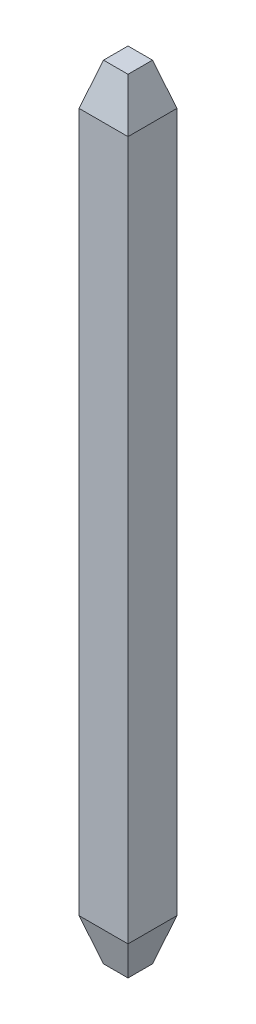
ISO-10303-21;
HEADER;
FILE_DESCRIPTION(('STEP AP214'),'2;1');
FILE_NAME('part.step','',(''),(''),'','','');
FILE_SCHEMA(('AUTOMOTIVE_DESIGN { 1 0 10303 214 1 1 1 1 }'));
ENDSEC;
DATA;
#1=APPLICATION_CONTEXT('core data for automotive mechanical design processes');
#2=APPLICATION_PROTOCOL_DEFINITION('international standard','automotive_design',2000,#1);
#3=PRODUCT_CONTEXT('',#1,'mechanical');
#4=PRODUCT('Part','Part','',(#3));
#5=PRODUCT_RELATED_PRODUCT_CATEGORY('part','',(#4));
#6=PRODUCT_DEFINITION_FORMATION('','',#4);
#7=PRODUCT_DEFINITION_CONTEXT('part definition',#1,'design');
#8=PRODUCT_DEFINITION('design','',#6,#7);
#9=PRODUCT_DEFINITION_SHAPE('','',#8);
#10=(LENGTH_UNIT() NAMED_UNIT(*) SI_UNIT(.MILLI.,.METRE.));
#11=(NAMED_UNIT(*) PLANE_ANGLE_UNIT() SI_UNIT($,.RADIAN.));
#12=(NAMED_UNIT(*) SI_UNIT($,.STERADIAN.) SOLID_ANGLE_UNIT());
#13=UNCERTAINTY_MEASURE_WITH_UNIT(LENGTH_MEASURE(1.E-05),#10,'distance_accuracy_value','');
#14=(GEOMETRIC_REPRESENTATION_CONTEXT(3) GLOBAL_UNCERTAINTY_ASSIGNED_CONTEXT((#13)) GLOBAL_UNIT_ASSIGNED_CONTEXT((#10,
#11,#12)) REPRESENTATION_CONTEXT('',''));
#15=CARTESIAN_POINT('',(0.,0.,0.));
#16=DIRECTION('',(0.,0.,1.));
#17=DIRECTION('',(1.,0.,0.));
#18=AXIS2_PLACEMENT_3D('',#15,#16,#17);
#19=CARTESIAN_POINT('',(11.5900000000129,-10.1039999999831,-19.8399999999763));
#20=DIRECTION('',(0.,-0.281214622974644,-0.959644900900968));
#21=DIRECTION('',(0.,-0.959644900900968,0.281214622974644));
#22=AXIS2_PLACEMENT_3D('',#19,#20,#21);
#23=PLANE('',#22);
#24=DIRECTION('',(1.,0.,0.));
#25=VECTOR('',#24,1.);
#26=CARTESIAN_POINT('',(11.2700000000129,-10.1039999999831,-19.8399999999763));
#27=LINE('',#26,#25);
#28=CARTESIAN_POINT('',(11.2700000000129,-10.1039999999831,-19.8399999999763));
#29=VERTEX_POINT('',#28);
#30=CARTESIAN_POINT('',(11.9100000000129,-10.1039999999831,-19.8399999999763));
#31=VERTEX_POINT('',#30);
#32=EDGE_CURVE('E11',#29,#31,#27,.T.);
#33=ORIENTED_EDGE('',*,*,#32,.T.);
#34=DIRECTION('',(-0.270714017147728,-0.923811583516617,0.270714017147728));
#35=VECTOR('',#34,1.);
#36=CARTESIAN_POINT('',(11.9100000000129,-10.1039999999831,-19.8399999999763));
#37=LINE('',#36,#35);
#38=CARTESIAN_POINT('',(11.7500000000129,-10.6499999999831,-19.6799999999763));
#39=VERTEX_POINT('',#38);
#40=EDGE_CURVE('E28',#31,#39,#37,.T.);
#41=ORIENTED_EDGE('',*,*,#40,.T.);
#42=DIRECTION('',(1.,0.,0.));
#43=VECTOR('',#42,1.);
#44=CARTESIAN_POINT('',(11.4300000000129,-10.6499999999831,-19.6799999999763));
#45=LINE('',#44,#43);
#46=CARTESIAN_POINT('',(11.4300000000129,-10.6499999999831,-19.6799999999763));
#47=VERTEX_POINT('',#46);
#48=EDGE_CURVE('E135',#47,#39,#45,.T.);
#49=ORIENTED_EDGE('',*,*,#48,.F.);
#50=DIRECTION('',(0.270714017147728,-0.923811583516617,0.270714017147728));
#51=VECTOR('',#50,1.);
#52=CARTESIAN_POINT('',(11.2700000000129,-10.1039999999831,-19.8399999999763));
#53=LINE('',#52,#51);
#54=EDGE_CURVE('E114',#29,#47,#53,.T.);
#55=ORIENTED_EDGE('',*,*,#54,.F.);
#56=EDGE_LOOP('',(#33,#41,#49,#55));
#57=FACE_BOUND('',#56,.T.);
#58=ADVANCED_FACE('F17',(#57),#23,.T.);
#59=CARTESIAN_POINT('',(11.9110000000129,-5.53443505344787,-19.8399999999763));
#60=DIRECTION('',(0.,0.,-1.));
#61=DIRECTION('',(0.,-1.,0.));
#62=AXIS2_PLACEMENT_3D('',#59,#60,#61);
#63=PLANE('',#62);
#64=DIRECTION('',(0.,1.,0.));
#65=VECTOR('',#64,1.);
#66=CARTESIAN_POINT('',(11.9100000000129,-10.1039999999831,-19.8399999999763));
#67=LINE('',#66,#65);
#68=CARTESIAN_POINT('',(11.9100000000129,-0.965870106912631,-19.8399999999763));
#69=VERTEX_POINT('',#68);
#70=EDGE_CURVE('E42',#31,#69,#67,.T.);
#71=ORIENTED_EDGE('',*,*,#70,.F.);
#72=ORIENTED_EDGE('',*,*,#32,.F.);
#73=DIRECTION('',(0.,1.,0.));
#74=VECTOR('',#73,1.);
#75=CARTESIAN_POINT('',(11.2700000000129,-10.1039999999831,-19.8399999999763));
#76=LINE('',#75,#74);
#77=CARTESIAN_POINT('',(11.2700000000129,-0.965870106912631,-19.8399999999763));
#78=VERTEX_POINT('',#77);
#79=EDGE_CURVE('E112',#29,#78,#76,.T.);
#80=ORIENTED_EDGE('',*,*,#79,.T.);
#81=DIRECTION('',(1.,0.,0.));
#82=VECTOR('',#81,1.);
#83=CARTESIAN_POINT('',(11.2700000000129,-0.965870106912629,-19.8399999999763));
#84=LINE('',#83,#82);
#85=EDGE_CURVE('E134',#78,#69,#84,.T.);
#86=ORIENTED_EDGE('',*,*,#85,.T.);
#87=EDGE_LOOP('',(#71,#72,#80,#86));
#88=FACE_BOUND('',#87,.T.);
#89=ADVANCED_FACE('F350',(#88),#63,.T.);
#90=CARTESIAN_POINT('',(11.9100000000129,-11.0738701069126,-19.5199999999763));
#91=DIRECTION('',(1.,0.,0.));
#92=DIRECTION('',(0.,1.,0.));
#93=AXIS2_PLACEMENT_3D('',#90,#91,#92);
#94=PLANE('',#93);
#95=DIRECTION('',(0.,1.,0.));
#96=VECTOR('',#95,1.);
#97=CARTESIAN_POINT('',(11.9100000000129,-10.1039999999831,-19.1999999999763));
#98=LINE('',#97,#96);
#99=CARTESIAN_POINT('',(11.9100000000129,-10.1039999999831,-19.1999999999763));
#100=VERTEX_POINT('',#99);
#101=CARTESIAN_POINT('',(11.9100000000129,-0.965870106912631,-19.1999999999763));
#102=VERTEX_POINT('',#101);
#103=EDGE_CURVE('E144',#100,#102,#98,.T.);
#104=ORIENTED_EDGE('',*,*,#103,.F.);
#105=DIRECTION('',(0.,0.,1.));
#106=VECTOR('',#105,1.);
#107=CARTESIAN_POINT('',(11.9100000000129,-10.1039999999831,-19.8399999999763));
#108=LINE('',#107,#106);
#109=EDGE_CURVE('E138',#31,#100,#108,.T.);
#110=ORIENTED_EDGE('',*,*,#109,.F.);
#111=ORIENTED_EDGE('',*,*,#70,.T.);
#112=DIRECTION('',(0.,0.,1.));
#113=VECTOR('',#112,1.);
#114=CARTESIAN_POINT('',(11.9100000000129,-0.965870106912629,-19.8399999999763));
#115=LINE('',#114,#113);
#116=EDGE_CURVE('E141',#69,#102,#115,.T.);
#117=ORIENTED_EDGE('',*,*,#116,.T.);
#118=EDGE_LOOP('',(#104,#110,#111,#117));
#119=FACE_BOUND('',#118,.T.);
#120=ADVANCED_FACE('F355',(#119),#94,.T.);
#121=CARTESIAN_POINT('',(11.269000000013,-5.53543505344787,-19.1999999999763));
#122=DIRECTION('',(0.,0.,1.));
#123=DIRECTION('',(1.,0.,0.));
#124=AXIS2_PLACEMENT_3D('',#121,#122,#123);
#125=PLANE('',#124);
#126=DIRECTION('',(0.,1.,0.));
#127=VECTOR('',#126,1.);
#128=CARTESIAN_POINT('',(11.2700000000129,-10.1039999999831,-19.1999999999763));
#129=LINE('',#128,#127);
#130=CARTESIAN_POINT('',(11.2700000000129,-10.1039999999831,-19.1999999999763));
#131=VERTEX_POINT('',#130);
#132=CARTESIAN_POINT('',(11.2700000000129,-0.965870106912631,-19.1999999999763));
#133=VERTEX_POINT('',#132);
#134=EDGE_CURVE('E68',#131,#133,#129,.T.);
#135=ORIENTED_EDGE('',*,*,#134,.F.);
#136=DIRECTION('',(-1.,0.,0.));
#137=VECTOR('',#136,1.);
#138=CARTESIAN_POINT('',(11.9100000000129,-10.1039999999831,-19.1999999999763));
#139=LINE('',#138,#137);
#140=EDGE_CURVE('E21',#100,#131,#139,.T.);
#141=ORIENTED_EDGE('',*,*,#140,.F.);
#142=ORIENTED_EDGE('',*,*,#103,.T.);
#143=DIRECTION('',(-1.,0.,0.));
#144=VECTOR('',#143,1.);
#145=CARTESIAN_POINT('',(11.9100000000129,-0.965870106912629,-19.1999999999763));
#146=LINE('',#145,#144);
#147=EDGE_CURVE('E80',#102,#133,#146,.T.);
#148=ORIENTED_EDGE('',*,*,#147,.T.);
#149=EDGE_LOOP('',(#135,#141,#142,#148));
#150=FACE_BOUND('',#149,.T.);
#151=ADVANCED_FACE('F76',(#150),#125,.T.);
#152=CARTESIAN_POINT('',(11.5900000000129,-0.965870106912629,-19.1999999999763));
#153=DIRECTION('',(0.,0.281214622974643,0.959644900900968));
#154=DIRECTION('',(1.,0.,0.));
#155=AXIS2_PLACEMENT_3D('',#152,#153,#154);
#156=PLANE('',#155);
#157=DIRECTION('',(-0.270714017147727,0.923811583516618,-0.270714017147727));
#158=VECTOR('',#157,1.);
#159=CARTESIAN_POINT('',(11.9100000000129,-0.965870106912629,-19.1999999999763));
#160=LINE('',#159,#158);
#161=CARTESIAN_POINT('',(11.7500000000129,-0.419870106912631,-19.3599999999763));
#162=VERTEX_POINT('',#161);
#163=EDGE_CURVE('E208',#102,#162,#160,.T.);
#164=ORIENTED_EDGE('',*,*,#163,.T.);
#165=DIRECTION('',(-1.,0.,0.));
#166=VECTOR('',#165,1.);
#167=CARTESIAN_POINT('',(11.7500000000129,-0.419870106912629,-19.3599999999763));
#168=LINE('',#167,#166);
#169=CARTESIAN_POINT('',(11.4300000000129,-0.419870106912631,-19.3599999999763));
#170=VERTEX_POINT('',#169);
#171=EDGE_CURVE('E212',#162,#170,#168,.T.);
#172=ORIENTED_EDGE('',*,*,#171,.T.);
#173=DIRECTION('',(0.270714017147727,0.923811583516618,-0.270714017147727));
#174=VECTOR('',#173,1.);
#175=CARTESIAN_POINT('',(11.2700000000129,-0.965870106912629,-19.1999999999763));
#176=LINE('',#175,#174);
#177=EDGE_CURVE('E222',#133,#170,#176,.T.);
#178=ORIENTED_EDGE('',*,*,#177,.F.);
#179=ORIENTED_EDGE('',*,*,#147,.F.);
#180=EDGE_LOOP('',(#164,#172,#178,#179));
#181=FACE_BOUND('',#180,.T.);
#182=ADVANCED_FACE('F322',(#181),#156,.T.);
#183=CARTESIAN_POINT('',(11.2700000000129,-0.965870106912629,-19.5199999999763));
#184=DIRECTION('',(-0.959644900900968,0.281214622974643,0.));
#185=DIRECTION('',(0.,0.,1.));
#186=AXIS2_PLACEMENT_3D('',#183,#184,#185);
#187=PLANE('',#186);
#188=ORIENTED_EDGE('',*,*,#177,.T.);
#189=DIRECTION('',(0.,0.,-1.));
#190=VECTOR('',#189,1.);
#191=CARTESIAN_POINT('',(11.4300000000129,-0.419870106912629,-19.3599999999763));
#192=LINE('',#191,#190);
#193=CARTESIAN_POINT('',(11.4300000000129,-0.419870106912631,-19.6799999999763));
#194=VERTEX_POINT('',#193);
#195=EDGE_CURVE('E108',#170,#194,#192,.T.);
#196=ORIENTED_EDGE('',*,*,#195,.T.);
#197=DIRECTION('',(0.270714017147727,0.923811583516618,0.270714017147727));
#198=VECTOR('',#197,1.);
#199=CARTESIAN_POINT('',(11.2700000000129,-0.965870106912629,-19.8399999999763));
#200=LINE('',#199,#198);
#201=EDGE_CURVE('E131',#78,#194,#200,.T.);
#202=ORIENTED_EDGE('',*,*,#201,.F.);
#203=DIRECTION('',(0.,0.,-1.));
#204=VECTOR('',#203,1.);
#205=CARTESIAN_POINT('',(11.2700000000129,-0.965870106912629,-19.1999999999763));
#206=LINE('',#205,#204);
#207=EDGE_CURVE('E84',#133,#78,#206,.T.);
#208=ORIENTED_EDGE('',*,*,#207,.F.);
#209=EDGE_LOOP('',(#188,#196,#202,#208));
#210=FACE_BOUND('',#209,.T.);
#211=ADVANCED_FACE('F231',(#210),#187,.T.);
#212=CARTESIAN_POINT('',(11.5900000000129,-0.419870106912629,-19.6809999999763));
#213=DIRECTION('',(0.,1.,0.));
#214=DIRECTION('',(1.,0.,0.));
#215=AXIS2_PLACEMENT_3D('',#212,#213,#214);
#216=PLANE('',#215);
#217=DIRECTION('',(1.,0.,0.));
#218=VECTOR('',#217,1.);
#219=CARTESIAN_POINT('',(11.4300000000129,-0.419870106912629,-19.6799999999763));
#220=LINE('',#219,#218);
#221=CARTESIAN_POINT('',(11.7500000000129,-0.419870106912631,-19.6799999999763));
#222=VERTEX_POINT('',#221);
#223=EDGE_CURVE('E83',#194,#222,#220,.T.);
#224=ORIENTED_EDGE('',*,*,#223,.F.);
#225=ORIENTED_EDGE('',*,*,#195,.F.);
#226=ORIENTED_EDGE('',*,*,#171,.F.);
#227=DIRECTION('',(0.,0.,1.));
#228=VECTOR('',#227,1.);
#229=CARTESIAN_POINT('',(11.7500000000129,-0.419870106912629,-19.6799999999763));
#230=LINE('',#229,#228);
#231=EDGE_CURVE('E127',#222,#162,#230,.T.);
#232=ORIENTED_EDGE('',*,*,#231,.F.);
#233=EDGE_LOOP('',(#224,#225,#226,#232));
#234=FACE_BOUND('',#233,.T.);
#235=ADVANCED_FACE('F233',(#234),#216,.T.);
#236=CARTESIAN_POINT('',(11.5900000000129,-10.1039999999831,-19.1999999999763));
#237=DIRECTION('',(0.,-0.281214622974644,0.959644900900968));
#238=DIRECTION('',(-1.,0.,0.));
#239=AXIS2_PLACEMENT_3D('',#236,#237,#238);
#240=PLANE('',#239);
#241=ORIENTED_EDGE('',*,*,#140,.T.);
#242=DIRECTION('',(0.270714017147728,-0.923811583516617,-0.270714017147728));
#243=VECTOR('',#242,1.);
#244=CARTESIAN_POINT('',(11.2700000000129,-10.1039999999831,-19.1999999999763));
#245=LINE('',#244,#243);
#246=CARTESIAN_POINT('',(11.4300000000129,-10.6499999999831,-19.3599999999763));
#247=VERTEX_POINT('',#246);
#248=EDGE_CURVE('E90',#131,#247,#245,.T.);
#249=ORIENTED_EDGE('',*,*,#248,.T.);
#250=DIRECTION('',(-1.,0.,0.));
#251=VECTOR('',#250,1.);
#252=CARTESIAN_POINT('',(11.7500000000129,-10.6499999999831,-19.3599999999763));
#253=LINE('',#252,#251);
#254=CARTESIAN_POINT('',(11.7500000000129,-10.6499999999831,-19.3599999999763));
#255=VERTEX_POINT('',#254);
#256=EDGE_CURVE('E197',#255,#247,#253,.T.);
#257=ORIENTED_EDGE('',*,*,#256,.F.);
#258=DIRECTION('',(-0.270714017147728,-0.923811583516617,-0.270714017147728));
#259=VECTOR('',#258,1.);
#260=CARTESIAN_POINT('',(11.9100000000129,-10.1039999999831,-19.1999999999763));
#261=LINE('',#260,#259);
#262=EDGE_CURVE('E106',#100,#255,#261,.T.);
#263=ORIENTED_EDGE('',*,*,#262,.F.);
#264=EDGE_LOOP('',(#241,#249,#257,#263));
#265=FACE_BOUND('',#264,.T.);
#266=ADVANCED_FACE('F104',(#265),#240,.T.);
#267=CARTESIAN_POINT('',(11.9100000000129,-0.965870106912629,-19.5199999999763));
#268=DIRECTION('',(0.959644900900968,0.281214622974643,0.));
#269=DIRECTION('',(0.,0.,-1.));
#270=AXIS2_PLACEMENT_3D('',#267,#268,#269);
#271=PLANE('',#270);
#272=DIRECTION('',(-0.270714017147727,0.923811583516618,0.270714017147727));
#273=VECTOR('',#272,1.);
#274=CARTESIAN_POINT('',(11.9100000000129,-0.965870106912629,-19.8399999999763));
#275=LINE('',#274,#273);
#276=EDGE_CURVE('E101',#69,#222,#275,.T.);
#277=ORIENTED_EDGE('',*,*,#276,.T.);
#278=ORIENTED_EDGE('',*,*,#231,.T.);
#279=ORIENTED_EDGE('',*,*,#163,.F.);
#280=ORIENTED_EDGE('',*,*,#116,.F.);
#281=EDGE_LOOP('',(#277,#278,#279,#280));
#282=FACE_BOUND('',#281,.T.);
#283=ADVANCED_FACE('F153',(#282),#271,.T.);
#284=CARTESIAN_POINT('',(11.5900000000129,-0.965870106912629,-19.8399999999763));
#285=DIRECTION('',(0.,0.281214622974643,-0.959644900900968));
#286=DIRECTION('',(-1.,0.,0.));
#287=AXIS2_PLACEMENT_3D('',#284,#285,#286);
#288=PLANE('',#287);
#289=ORIENTED_EDGE('',*,*,#201,.T.);
#290=ORIENTED_EDGE('',*,*,#223,.T.);
#291=ORIENTED_EDGE('',*,*,#276,.F.);
#292=ORIENTED_EDGE('',*,*,#85,.F.);
#293=EDGE_LOOP('',(#289,#290,#291,#292));
#294=FACE_BOUND('',#293,.T.);
#295=ADVANCED_FACE('F164',(#294),#288,.T.);
#296=CARTESIAN_POINT('',(11.2700000000129,-5.53543505344786,-19.1989999999763));
#297=DIRECTION('',(-1.,0.,0.));
#298=DIRECTION('',(0.,0.,1.));
#299=AXIS2_PLACEMENT_3D('',#296,#297,#298);
#300=PLANE('',#299);
#301=ORIENTED_EDGE('',*,*,#79,.F.);
#302=DIRECTION('',(0.,0.,-1.));
#303=VECTOR('',#302,1.);
#304=CARTESIAN_POINT('',(11.2700000000129,-10.1039999999831,-19.1999999999763));
#305=LINE('',#304,#303);
#306=EDGE_CURVE('E94',#131,#29,#305,.T.);
#307=ORIENTED_EDGE('',*,*,#306,.F.);
#308=ORIENTED_EDGE('',*,*,#134,.T.);
#309=ORIENTED_EDGE('',*,*,#207,.T.);
#310=EDGE_LOOP('',(#301,#307,#308,#309));
#311=FACE_BOUND('',#310,.T.);
#312=ADVANCED_FACE('F110',(#311),#300,.T.);
#313=CARTESIAN_POINT('',(11.2700000000129,-10.1039999999831,-19.5199999999763));
#314=DIRECTION('',(-0.959644900900968,-0.281214622974644,0.));
#315=DIRECTION('',(-0.281214622974644,0.959644900900968,0.));
#316=AXIS2_PLACEMENT_3D('',#313,#314,#315);
#317=PLANE('',#316);
#318=ORIENTED_EDGE('',*,*,#306,.T.);
#319=ORIENTED_EDGE('',*,*,#54,.T.);
#320=DIRECTION('',(0.,0.,-1.));
#321=VECTOR('',#320,1.);
#322=CARTESIAN_POINT('',(11.4300000000129,-10.6499999999831,-19.3599999999763));
#323=LINE('',#322,#321);
#324=EDGE_CURVE('E97',#247,#47,#323,.T.);
#325=ORIENTED_EDGE('',*,*,#324,.F.);
#326=ORIENTED_EDGE('',*,*,#248,.F.);
#327=EDGE_LOOP('',(#318,#319,#325,#326));
#328=FACE_BOUND('',#327,.T.);
#329=ADVANCED_FACE('F91',(#328),#317,.T.);
#330=CARTESIAN_POINT('',(11.4290000000129,-10.6499999999831,-19.5199999999763));
#331=DIRECTION('',(0.,-1.,0.));
#332=DIRECTION('',(0.,0.,-1.));
#333=AXIS2_PLACEMENT_3D('',#330,#331,#332);
#334=PLANE('',#333);
#335=DIRECTION('',(0.,0.,1.));
#336=VECTOR('',#335,1.);
#337=CARTESIAN_POINT('',(11.7500000000129,-10.6499999999831,-19.6799999999763));
#338=LINE('',#337,#336);
#339=EDGE_CURVE('E122',#39,#255,#338,.T.);
#340=ORIENTED_EDGE('',*,*,#339,.T.);
#341=ORIENTED_EDGE('',*,*,#256,.T.);
#342=ORIENTED_EDGE('',*,*,#324,.T.);
#343=ORIENTED_EDGE('',*,*,#48,.T.);
#344=EDGE_LOOP('',(#340,#341,#342,#343));
#345=FACE_BOUND('',#344,.T.);
#346=ADVANCED_FACE('F196',(#345),#334,.T.);
#347=CARTESIAN_POINT('',(11.9100000000129,-10.1039999999831,-19.5199999999763));
#348=DIRECTION('',(0.959644900900968,-0.281214622974644,0.));
#349=DIRECTION('',(0.,0.,-1.));
#350=AXIS2_PLACEMENT_3D('',#347,#348,#349);
#351=PLANE('',#350);
#352=ORIENTED_EDGE('',*,*,#109,.T.);
#353=ORIENTED_EDGE('',*,*,#262,.T.);
#354=ORIENTED_EDGE('',*,*,#339,.F.);
#355=ORIENTED_EDGE('',*,*,#40,.F.);
#356=EDGE_LOOP('',(#352,#353,#354,#355));
#357=FACE_BOUND('',#356,.T.);
#358=ADVANCED_FACE('F19',(#357),#351,.T.);
#359=CLOSED_SHELL('',(#58,#89,#120,#151,#182,#211,#235,#266,#283,#295,#312,#329,#346,#358));
#360=MANIFOLD_SOLID_BREP('B1',#359);
#361=ADVANCED_BREP_SHAPE_REPRESENTATION('',(#18,#360),#14);
#362=SHAPE_DEFINITION_REPRESENTATION(#9,#361);
ENDSEC;
END-ISO-10303-21;
